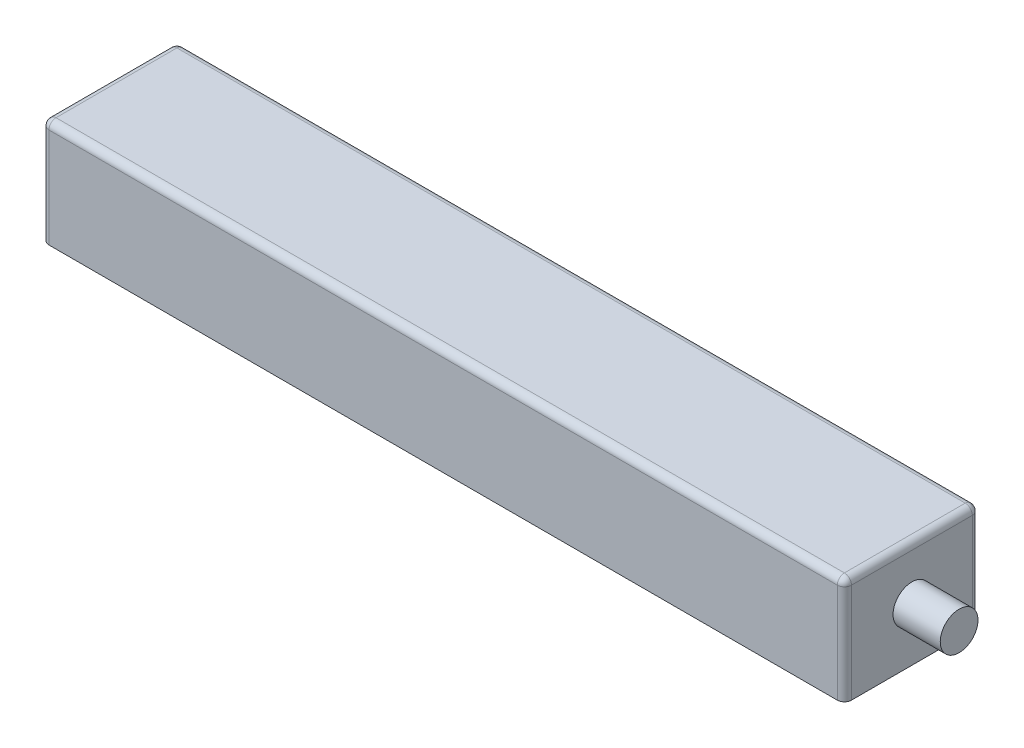
ISO-10303-21;
HEADER;
FILE_DESCRIPTION(('STEP AP214'),'2;1');
FILE_NAME('part.step','',(''),(''),'','','');
FILE_SCHEMA(('AUTOMOTIVE_DESIGN { 1 0 10303 214 1 1 1 1 }'));
ENDSEC;
DATA;
#1=APPLICATION_CONTEXT('core data for automotive mechanical design processes');
#2=APPLICATION_PROTOCOL_DEFINITION('international standard','automotive_design',2000,#1);
#3=PRODUCT_CONTEXT('',#1,'mechanical');
#4=PRODUCT('Part','Part','',(#3));
#5=PRODUCT_RELATED_PRODUCT_CATEGORY('part','',(#4));
#6=PRODUCT_DEFINITION_FORMATION('','',#4);
#7=PRODUCT_DEFINITION_CONTEXT('part definition',#1,'design');
#8=PRODUCT_DEFINITION('design','',#6,#7);
#9=PRODUCT_DEFINITION_SHAPE('','',#8);
#10=(LENGTH_UNIT() NAMED_UNIT(*) SI_UNIT(.MILLI.,.METRE.));
#11=(NAMED_UNIT(*) PLANE_ANGLE_UNIT() SI_UNIT($,.RADIAN.));
#12=(NAMED_UNIT(*) SI_UNIT($,.STERADIAN.) SOLID_ANGLE_UNIT());
#13=UNCERTAINTY_MEASURE_WITH_UNIT(LENGTH_MEASURE(1.E-05),#10,'distance_accuracy_value','');
#14=(GEOMETRIC_REPRESENTATION_CONTEXT(3) GLOBAL_UNCERTAINTY_ASSIGNED_CONTEXT((#13)) GLOBAL_UNIT_ASSIGNED_CONTEXT((#10,
#11,#12)) REPRESENTATION_CONTEXT('',''));
#15=CARTESIAN_POINT('',(0.,0.,0.));
#16=DIRECTION('',(0.,0.,1.));
#17=DIRECTION('',(1.,0.,0.));
#18=AXIS2_PLACEMENT_3D('',#15,#16,#17);
#19=CARTESIAN_POINT('',(-85.,22.6,14.3));
#20=DIRECTION('',(1.,0.,0.));
#21=DIRECTION('',(0.,0.,-1.));
#22=AXIS2_PLACEMENT_3D('',#19,#20,#21);
#23=PLANE('',#22);
#24=DIRECTION('',(0.,0.,1.));
#25=VECTOR('',#24,1.);
#26=CARTESIAN_POINT('',(-85.,21.1,-14.3));
#27=LINE('',#26,#25);
#28=CARTESIAN_POINT('',(-85.,21.1,12.8));
#29=VERTEX_POINT('',#28);
#30=CARTESIAN_POINT('',(-85.,21.1,-12.8));
#31=VERTEX_POINT('',#30);
#32=EDGE_CURVE('E50',#29,#31,#27,.F.);
#33=ORIENTED_EDGE('',*,*,#32,.T.);
#34=DIRECTION('',(0.,-1.,0.));
#35=VECTOR('',#34,1.);
#36=CARTESIAN_POINT('',(-85.,22.6,-12.8));
#37=LINE('',#36,#35);
#38=CARTESIAN_POINT('',(-85.,0.,-12.8));
#39=VERTEX_POINT('',#38);
#40=EDGE_CURVE('E169',#31,#39,#37,.T.);
#41=ORIENTED_EDGE('',*,*,#40,.T.);
#42=DIRECTION('',(0.,0.,1.));
#43=VECTOR('',#42,1.);
#44=CARTESIAN_POINT('',(-85.,0.,14.3));
#45=LINE('',#44,#43);
#46=CARTESIAN_POINT('',(-85.,0.,12.8));
#47=VERTEX_POINT('',#46);
#48=EDGE_CURVE('E206',#39,#47,#45,.T.);
#49=ORIENTED_EDGE('',*,*,#48,.T.);
#50=DIRECTION('',(0.,-1.,0.));
#51=VECTOR('',#50,1.);
#52=CARTESIAN_POINT('',(-85.,22.6,12.8));
#53=LINE('',#52,#51);
#54=EDGE_CURVE('E55',#47,#29,#53,.F.);
#55=ORIENTED_EDGE('',*,*,#54,.T.);
#56=EDGE_LOOP('',(#33,#41,#49,#55));
#57=FACE_BOUND('',#56,.T.);
#58=CARTESIAN_POINT('',(-85.,11.3,0.));
#59=DIRECTION('',(1.,0.,0.));
#60=DIRECTION('',(0.,0.,-1.));
#61=AXIS2_PLACEMENT_3D('',#58,#59,#60);
#62=CIRCLE('',#61,4.);
#63=CARTESIAN_POINT('',(-85.,11.3,-4.));
#64=VERTEX_POINT('',#63);
#65=EDGE_CURVE('E140',#64,#64,#62,.F.);
#66=ORIENTED_EDGE('',*,*,#65,.F.);
#67=EDGE_LOOP('',(#66));
#68=FACE_BOUND('',#67,.T.);
#69=ADVANCED_FACE('F33',(#57,#68),#23,.F.);
#70=CARTESIAN_POINT('',(85.,22.6,14.3));
#71=DIRECTION('',(-1.,0.,0.));
#72=DIRECTION('',(0.,0.,1.));
#73=AXIS2_PLACEMENT_3D('',#70,#71,#72);
#74=PLANE('',#73);
#75=DIRECTION('',(0.,0.,-1.));
#76=VECTOR('',#75,1.);
#77=CARTESIAN_POINT('',(85.,0.,14.3));
#78=LINE('',#77,#76);
#79=CARTESIAN_POINT('',(85.,0.,12.8));
#80=VERTEX_POINT('',#79);
#81=CARTESIAN_POINT('',(85.,0.,-12.8));
#82=VERTEX_POINT('',#81);
#83=EDGE_CURVE('E213',#80,#82,#78,.T.);
#84=ORIENTED_EDGE('',*,*,#83,.T.);
#85=DIRECTION('',(0.,-1.,0.));
#86=VECTOR('',#85,1.);
#87=CARTESIAN_POINT('',(85.,22.6,-12.8));
#88=LINE('',#87,#86);
#89=CARTESIAN_POINT('',(85.,21.1,-12.8));
#90=VERTEX_POINT('',#89);
#91=EDGE_CURVE('E159',#82,#90,#88,.F.);
#92=ORIENTED_EDGE('',*,*,#91,.T.);
#93=DIRECTION('',(0.,0.,-1.));
#94=VECTOR('',#93,1.);
#95=CARTESIAN_POINT('',(85.,21.1,14.3));
#96=LINE('',#95,#94);
#97=CARTESIAN_POINT('',(85.,21.1,12.8));
#98=VERTEX_POINT('',#97);
#99=EDGE_CURVE('E157',#90,#98,#96,.F.);
#100=ORIENTED_EDGE('',*,*,#99,.T.);
#101=DIRECTION('',(0.,-1.,0.));
#102=VECTOR('',#101,1.);
#103=CARTESIAN_POINT('',(85.,22.6,12.8));
#104=LINE('',#103,#102);
#105=EDGE_CURVE('E155',#98,#80,#104,.T.);
#106=ORIENTED_EDGE('',*,*,#105,.T.);
#107=EDGE_LOOP('',(#84,#92,#100,#106));
#108=FACE_BOUND('',#107,.T.);
#109=CARTESIAN_POINT('',(85.,11.3,0.));
#110=DIRECTION('',(-1.,0.,0.));
#111=DIRECTION('',(0.,0.,1.));
#112=AXIS2_PLACEMENT_3D('',#109,#110,#111);
#113=CIRCLE('',#112,4.);
#114=CARTESIAN_POINT('',(85.,11.3,4.));
#115=VERTEX_POINT('',#114);
#116=EDGE_CURVE('E219',#115,#115,#113,.F.);
#117=ORIENTED_EDGE('',*,*,#116,.F.);
#118=EDGE_LOOP('',(#117));
#119=FACE_BOUND('',#118,.T.);
#120=ADVANCED_FACE('F267',(#108,#119),#74,.F.);
#121=CARTESIAN_POINT('',(85.,22.6,14.3));
#122=DIRECTION('',(0.,0.,-1.));
#123=DIRECTION('',(-1.,0.,0.));
#124=AXIS2_PLACEMENT_3D('',#121,#122,#123);
#125=PLANE('',#124);
#126=DIRECTION('',(1.,0.,0.));
#127=VECTOR('',#126,1.);
#128=CARTESIAN_POINT('',(-85.,21.1,14.3));
#129=LINE('',#128,#127);
#130=CARTESIAN_POINT('',(83.5,21.1,14.3));
#131=VERTEX_POINT('',#130);
#132=CARTESIAN_POINT('',(-83.5,21.1,14.3));
#133=VERTEX_POINT('',#132);
#134=EDGE_CURVE('E163',#131,#133,#129,.F.);
#135=ORIENTED_EDGE('',*,*,#134,.T.);
#136=DIRECTION('',(0.,-1.,0.));
#137=VECTOR('',#136,1.);
#138=CARTESIAN_POINT('',(-83.5,22.6,14.3));
#139=LINE('',#138,#137);
#140=CARTESIAN_POINT('',(-83.5,0.,14.3));
#141=VERTEX_POINT('',#140);
#142=EDGE_CURVE('E165',#133,#141,#139,.T.);
#143=ORIENTED_EDGE('',*,*,#142,.T.);
#144=DIRECTION('',(1.,0.,0.));
#145=VECTOR('',#144,1.);
#146=CARTESIAN_POINT('',(85.,0.,14.3));
#147=LINE('',#146,#145);
#148=CARTESIAN_POINT('',(83.5,0.,14.3));
#149=VERTEX_POINT('',#148);
#150=EDGE_CURVE('E210',#141,#149,#147,.T.);
#151=ORIENTED_EDGE('',*,*,#150,.T.);
#152=DIRECTION('',(0.,-1.,0.));
#153=VECTOR('',#152,1.);
#154=CARTESIAN_POINT('',(83.5,22.6,14.3));
#155=LINE('',#154,#153);
#156=EDGE_CURVE('E161',#149,#131,#155,.F.);
#157=ORIENTED_EDGE('',*,*,#156,.T.);
#158=EDGE_LOOP('',(#135,#143,#151,#157));
#159=FACE_BOUND('',#158,.T.);
#160=ADVANCED_FACE('F273',(#159),#125,.F.);
#161=CARTESIAN_POINT('',(85.,22.6,-14.3));
#162=DIRECTION('',(0.,0.,1.));
#163=DIRECTION('',(1.,0.,0.));
#164=AXIS2_PLACEMENT_3D('',#161,#162,#163);
#165=PLANE('',#164);
#166=DIRECTION('',(-1.,0.,0.));
#167=VECTOR('',#166,1.);
#168=CARTESIAN_POINT('',(85.,0.,-14.3));
#169=LINE('',#168,#167);
#170=CARTESIAN_POINT('',(83.5,0.,-14.3));
#171=VERTEX_POINT('',#170);
#172=CARTESIAN_POINT('',(-83.5,0.,-14.3));
#173=VERTEX_POINT('',#172);
#174=EDGE_CURVE('E216',#171,#173,#169,.T.);
#175=ORIENTED_EDGE('',*,*,#174,.T.);
#176=DIRECTION('',(0.,-1.,0.));
#177=VECTOR('',#176,1.);
#178=CARTESIAN_POINT('',(-83.5,22.6,-14.3));
#179=LINE('',#178,#177);
#180=CARTESIAN_POINT('',(-83.5,21.1,-14.3));
#181=VERTEX_POINT('',#180);
#182=EDGE_CURVE('E153',#173,#181,#179,.F.);
#183=ORIENTED_EDGE('',*,*,#182,.T.);
#184=DIRECTION('',(-1.,0.,0.));
#185=VECTOR('',#184,1.);
#186=CARTESIAN_POINT('',(85.,21.1,-14.3));
#187=LINE('',#186,#185);
#188=CARTESIAN_POINT('',(83.5,21.1,-14.3));
#189=VERTEX_POINT('',#188);
#190=EDGE_CURVE('E118',#181,#189,#187,.F.);
#191=ORIENTED_EDGE('',*,*,#190,.T.);
#192=DIRECTION('',(0.,-1.,0.));
#193=VECTOR('',#192,1.);
#194=CARTESIAN_POINT('',(83.5,22.6,-14.3));
#195=LINE('',#194,#193);
#196=EDGE_CURVE('E146',#189,#171,#195,.T.);
#197=ORIENTED_EDGE('',*,*,#196,.T.);
#198=EDGE_LOOP('',(#175,#183,#191,#197));
#199=FACE_BOUND('',#198,.T.);
#200=ADVANCED_FACE('F242',(#199),#165,.F.);
#201=CARTESIAN_POINT('',(-85.,22.6,-14.3));
#202=DIRECTION('',(0.,1.,0.));
#203=DIRECTION('',(0.,0.,1.));
#204=AXIS2_PLACEMENT_3D('',#201,#202,#203);
#205=PLANE('',#204);
#206=DIRECTION('',(0.,0.,-1.));
#207=VECTOR('',#206,1.);
#208=CARTESIAN_POINT('',(83.5,22.6,-14.3));
#209=LINE('',#208,#207);
#210=CARTESIAN_POINT('',(83.5,22.6,12.8));
#211=VERTEX_POINT('',#210);
#212=CARTESIAN_POINT('',(83.5,22.6,-12.8));
#213=VERTEX_POINT('',#212);
#214=EDGE_CURVE('E144',#211,#213,#209,.T.);
#215=ORIENTED_EDGE('',*,*,#214,.T.);
#216=DIRECTION('',(-1.,0.,0.));
#217=VECTOR('',#216,1.);
#218=CARTESIAN_POINT('',(-85.,22.6,-12.8));
#219=LINE('',#218,#217);
#220=CARTESIAN_POINT('',(-83.5,22.6,-12.8));
#221=VERTEX_POINT('',#220);
#222=EDGE_CURVE('E116',#213,#221,#219,.T.);
#223=ORIENTED_EDGE('',*,*,#222,.T.);
#224=DIRECTION('',(0.,0.,1.));
#225=VECTOR('',#224,1.);
#226=CARTESIAN_POINT('',(-83.5,22.6,14.3));
#227=LINE('',#226,#225);
#228=CARTESIAN_POINT('',(-83.5,22.6,12.8));
#229=VERTEX_POINT('',#228);
#230=EDGE_CURVE('E133',#221,#229,#227,.T.);
#231=ORIENTED_EDGE('',*,*,#230,.T.);
#232=DIRECTION('',(1.,0.,0.));
#233=VECTOR('',#232,1.);
#234=CARTESIAN_POINT('',(85.,22.6,12.8));
#235=LINE('',#234,#233);
#236=EDGE_CURVE('E139',#229,#211,#235,.T.);
#237=ORIENTED_EDGE('',*,*,#236,.T.);
#238=EDGE_LOOP('',(#215,#223,#231,#237));
#239=FACE_BOUND('',#238,.T.);
#240=ADVANCED_FACE('F142',(#239),#205,.T.);
#241=CARTESIAN_POINT('',(-85.,0.,-14.3));
#242=DIRECTION('',(0.,1.,0.));
#243=DIRECTION('',(0.,0.,1.));
#244=AXIS2_PLACEMENT_3D('',#241,#242,#243);
#245=PLANE('',#244);
#246=ORIENTED_EDGE('',*,*,#48,.F.);
#247=CARTESIAN_POINT('',(-83.5,0.,-12.8));
#248=DIRECTION('',(0.,1.,0.));
#249=DIRECTION('',(0.,0.,1.));
#250=AXIS2_PLACEMENT_3D('',#247,#248,#249);
#251=CIRCLE('',#250,1.5);
#252=EDGE_CURVE('E11',#39,#173,#251,.F.);
#253=ORIENTED_EDGE('',*,*,#252,.T.);
#254=ORIENTED_EDGE('',*,*,#174,.F.);
#255=CARTESIAN_POINT('',(83.5,0.,-12.8));
#256=DIRECTION('',(0.,1.,0.));
#257=DIRECTION('',(0.,0.,1.));
#258=AXIS2_PLACEMENT_3D('',#255,#256,#257);
#259=CIRCLE('',#258,1.5);
#260=EDGE_CURVE('E173',#171,#82,#259,.F.);
#261=ORIENTED_EDGE('',*,*,#260,.T.);
#262=ORIENTED_EDGE('',*,*,#83,.F.);
#263=CARTESIAN_POINT('',(83.5,0.,12.8));
#264=DIRECTION('',(0.,1.,0.));
#265=DIRECTION('',(0.,0.,1.));
#266=AXIS2_PLACEMENT_3D('',#263,#264,#265);
#267=CIRCLE('',#266,1.5);
#268=EDGE_CURVE('E171',#80,#149,#267,.F.);
#269=ORIENTED_EDGE('',*,*,#268,.T.);
#270=ORIENTED_EDGE('',*,*,#150,.F.);
#271=CARTESIAN_POINT('',(-83.5,0.,12.8));
#272=DIRECTION('',(0.,1.,0.));
#273=DIRECTION('',(0.,0.,1.));
#274=AXIS2_PLACEMENT_3D('',#271,#272,#273);
#275=CIRCLE('',#274,1.5);
#276=EDGE_CURVE('E42',#141,#47,#275,.F.);
#277=ORIENTED_EDGE('',*,*,#276,.T.);
#278=EDGE_LOOP('',(#246,#253,#254,#261,#262,#269,#270,#277));
#279=FACE_BOUND('',#278,.T.);
#280=ADVANCED_FACE('F250',(#279),#245,.F.);
#281=CARTESIAN_POINT('',(95.,11.3,0.));
#282=DIRECTION('',(-1.,0.,0.));
#283=DIRECTION('',(0.,0.,1.));
#284=AXIS2_PLACEMENT_3D('',#281,#282,#283);
#285=CYLINDRICAL_SURFACE('',#284,4.);
#286=CARTESIAN_POINT('',(95.,11.3,0.));
#287=DIRECTION('',(1.,0.,0.));
#288=DIRECTION('',(0.,0.,-1.));
#289=AXIS2_PLACEMENT_3D('',#286,#287,#288);
#290=CIRCLE('',#289,4.);
#291=CARTESIAN_POINT('',(95.,11.3,-4.));
#292=VERTEX_POINT('',#291);
#293=EDGE_CURVE('E201',#292,#292,#290,.T.);
#294=ORIENTED_EDGE('',*,*,#293,.F.);
#295=EDGE_LOOP('',(#294));
#296=FACE_BOUND('',#295,.T.);
#297=ORIENTED_EDGE('',*,*,#116,.T.);
#298=EDGE_LOOP('',(#297));
#299=FACE_BOUND('',#298,.T.);
#300=ADVANCED_FACE('F390',(#296,#299),#285,.T.);
#301=CARTESIAN_POINT('',(95.,11.3,0.));
#302=DIRECTION('',(1.,0.,0.));
#303=DIRECTION('',(0.,0.,-1.));
#304=AXIS2_PLACEMENT_3D('',#301,#302,#303);
#305=PLANE('',#304);
#306=ORIENTED_EDGE('',*,*,#293,.T.);
#307=EDGE_LOOP('',(#306));
#308=FACE_BOUND('',#307,.T.);
#309=ADVANCED_FACE('F374',(#308),#305,.T.);
#310=CARTESIAN_POINT('',(-90.,11.3,0.));
#311=DIRECTION('',(1.,0.,0.));
#312=DIRECTION('',(0.,0.,-1.));
#313=AXIS2_PLACEMENT_3D('',#310,#311,#312);
#314=CYLINDRICAL_SURFACE('',#313,4.);
#315=CARTESIAN_POINT('',(-90.,11.3,0.));
#316=DIRECTION('',(-1.,0.,0.));
#317=DIRECTION('',(0.,0.,1.));
#318=AXIS2_PLACEMENT_3D('',#315,#316,#317);
#319=CIRCLE('',#318,4.);
#320=CARTESIAN_POINT('',(-90.,11.3,4.));
#321=VERTEX_POINT('',#320);
#322=EDGE_CURVE('E198',#321,#321,#319,.T.);
#323=ORIENTED_EDGE('',*,*,#322,.F.);
#324=EDGE_LOOP('',(#323));
#325=FACE_BOUND('',#324,.T.);
#326=ORIENTED_EDGE('',*,*,#65,.T.);
#327=EDGE_LOOP('',(#326));
#328=FACE_BOUND('',#327,.T.);
#329=ADVANCED_FACE('F367',(#325,#328),#314,.T.);
#330=CARTESIAN_POINT('',(-90.,11.3,0.));
#331=DIRECTION('',(-1.,0.,0.));
#332=DIRECTION('',(0.,0.,1.));
#333=AXIS2_PLACEMENT_3D('',#330,#331,#332);
#334=PLANE('',#333);
#335=ORIENTED_EDGE('',*,*,#322,.T.);
#336=EDGE_LOOP('',(#335));
#337=FACE_BOUND('',#336,.T.);
#338=ADVANCED_FACE('F359',(#337),#334,.T.);
#339=CARTESIAN_POINT('',(83.5,22.6,12.8));
#340=DIRECTION('',(0.,-1.,0.));
#341=DIRECTION('',(0.,0.,-1.));
#342=AXIS2_PLACEMENT_3D('',#339,#340,#341);
#343=CYLINDRICAL_SURFACE('',#342,1.5);
#344=ORIENTED_EDGE('',*,*,#268,.F.);
#345=ORIENTED_EDGE('',*,*,#105,.F.);
#346=CARTESIAN_POINT('',(83.5,21.1,12.8));
#347=DIRECTION('',(0.,1.,0.));
#348=DIRECTION('',(0.,0.,1.));
#349=AXIS2_PLACEMENT_3D('',#346,#347,#348);
#350=CIRCLE('',#349,1.5);
#351=EDGE_CURVE('E37',#131,#98,#350,.T.);
#352=ORIENTED_EDGE('',*,*,#351,.F.);
#353=ORIENTED_EDGE('',*,*,#156,.F.);
#354=EDGE_LOOP('',(#344,#345,#352,#353));
#355=FACE_BOUND('',#354,.T.);
#356=ADVANCED_FACE('F35',(#355),#343,.T.);
#357=CARTESIAN_POINT('',(-85.,21.1,12.8));
#358=DIRECTION('',(-1.,0.,0.));
#359=DIRECTION('',(0.,0.,1.));
#360=AXIS2_PLACEMENT_3D('',#357,#358,#359);
#361=CYLINDRICAL_SURFACE('',#360,1.5);
#362=CARTESIAN_POINT('',(-83.5,21.1,12.8));
#363=DIRECTION('',(-1.,0.,0.));
#364=DIRECTION('',(0.,0.,1.));
#365=AXIS2_PLACEMENT_3D('',#362,#363,#364);
#366=CIRCLE('',#365,1.5);
#367=EDGE_CURVE('E190',#133,#229,#366,.T.);
#368=ORIENTED_EDGE('',*,*,#367,.F.);
#369=ORIENTED_EDGE('',*,*,#134,.F.);
#370=CARTESIAN_POINT('',(83.5,21.1,12.8));
#371=DIRECTION('',(1.,0.,0.));
#372=DIRECTION('',(0.,0.,-1.));
#373=AXIS2_PLACEMENT_3D('',#370,#371,#372);
#374=CIRCLE('',#373,1.5);
#375=EDGE_CURVE('E192',#211,#131,#374,.T.);
#376=ORIENTED_EDGE('',*,*,#375,.F.);
#377=ORIENTED_EDGE('',*,*,#236,.F.);
#378=EDGE_LOOP('',(#368,#369,#376,#377));
#379=FACE_BOUND('',#378,.T.);
#380=ADVANCED_FACE('F226',(#379),#361,.T.);
#381=CARTESIAN_POINT('',(-83.5,22.6,12.8));
#382=DIRECTION('',(0.,-1.,0.));
#383=DIRECTION('',(0.,0.,-1.));
#384=AXIS2_PLACEMENT_3D('',#381,#382,#383);
#385=CYLINDRICAL_SURFACE('',#384,1.5);
#386=ORIENTED_EDGE('',*,*,#276,.F.);
#387=ORIENTED_EDGE('',*,*,#142,.F.);
#388=CARTESIAN_POINT('',(-83.5,21.1,12.8));
#389=DIRECTION('',(0.,1.,0.));
#390=DIRECTION('',(0.,0.,1.));
#391=AXIS2_PLACEMENT_3D('',#388,#389,#390);
#392=CIRCLE('',#391,1.5);
#393=EDGE_CURVE('E187',#29,#133,#392,.T.);
#394=ORIENTED_EDGE('',*,*,#393,.F.);
#395=ORIENTED_EDGE('',*,*,#54,.F.);
#396=EDGE_LOOP('',(#386,#387,#394,#395));
#397=FACE_BOUND('',#396,.T.);
#398=ADVANCED_FACE('F255',(#397),#385,.T.);
#399=CARTESIAN_POINT('',(83.5,21.1,12.8));
#400=DIRECTION('',(0.,0.,1.));
#401=DIRECTION('',(1.,0.,0.));
#402=AXIS2_PLACEMENT_3D('',#399,#400,#401);
#403=SPHERICAL_SURFACE('',#402,1.5);
#404=ORIENTED_EDGE('',*,*,#375,.T.);
#405=ORIENTED_EDGE('',*,*,#351,.T.);
#406=CARTESIAN_POINT('',(83.5,21.1,12.8));
#407=DIRECTION('',(0.,0.,1.));
#408=DIRECTION('',(0.,-1.,0.));
#409=AXIS2_PLACEMENT_3D('',#406,#407,#408);
#410=CIRCLE('',#409,1.5);
#411=EDGE_CURVE('E184',#211,#98,#410,.F.);
#412=ORIENTED_EDGE('',*,*,#411,.F.);
#413=EDGE_LOOP('',(#404,#405,#412));
#414=FACE_BOUND('',#413,.T.);
#415=ADVANCED_FACE('F227',(#414),#403,.T.);
#416=CARTESIAN_POINT('',(-83.5,21.1,12.8));
#417=DIRECTION('',(0.,0.,1.));
#418=DIRECTION('',(1.,0.,0.));
#419=AXIS2_PLACEMENT_3D('',#416,#417,#418);
#420=SPHERICAL_SURFACE('',#419,1.5);
#421=ORIENTED_EDGE('',*,*,#393,.T.);
#422=ORIENTED_EDGE('',*,*,#367,.T.);
#423=CARTESIAN_POINT('',(-83.5,21.1,12.8));
#424=DIRECTION('',(0.,0.,1.));
#425=DIRECTION('',(1.,0.,0.));
#426=AXIS2_PLACEMENT_3D('',#423,#424,#425);
#427=CIRCLE('',#426,1.5);
#428=EDGE_CURVE('E136',#29,#229,#427,.F.);
#429=ORIENTED_EDGE('',*,*,#428,.F.);
#430=EDGE_LOOP('',(#421,#422,#429));
#431=FACE_BOUND('',#430,.T.);
#432=ADVANCED_FACE('F257',(#431),#420,.T.);
#433=CARTESIAN_POINT('',(83.5,22.6,-12.8));
#434=DIRECTION('',(0.,-1.,0.));
#435=DIRECTION('',(0.,0.,-1.));
#436=AXIS2_PLACEMENT_3D('',#433,#434,#435);
#437=CYLINDRICAL_SURFACE('',#436,1.5);
#438=ORIENTED_EDGE('',*,*,#260,.F.);
#439=ORIENTED_EDGE('',*,*,#196,.F.);
#440=CARTESIAN_POINT('',(83.5,21.1,-12.8));
#441=DIRECTION('',(0.,1.,0.));
#442=DIRECTION('',(0.,0.,1.));
#443=AXIS2_PLACEMENT_3D('',#440,#441,#442);
#444=CIRCLE('',#443,1.5);
#445=EDGE_CURVE('E180',#90,#189,#444,.T.);
#446=ORIENTED_EDGE('',*,*,#445,.F.);
#447=ORIENTED_EDGE('',*,*,#91,.F.);
#448=EDGE_LOOP('',(#438,#439,#446,#447));
#449=FACE_BOUND('',#448,.T.);
#450=ADVANCED_FACE('F239',(#449),#437,.T.);
#451=CARTESIAN_POINT('',(83.5,21.1,-14.3));
#452=DIRECTION('',(0.,0.,1.));
#453=DIRECTION('',(1.,0.,0.));
#454=AXIS2_PLACEMENT_3D('',#451,#452,#453);
#455=CYLINDRICAL_SURFACE('',#454,1.5);
#456=ORIENTED_EDGE('',*,*,#411,.T.);
#457=ORIENTED_EDGE('',*,*,#99,.F.);
#458=CARTESIAN_POINT('',(83.5,21.1,-12.8));
#459=DIRECTION('',(0.,0.,-1.));
#460=DIRECTION('',(-1.,0.,0.));
#461=AXIS2_PLACEMENT_3D('',#458,#459,#460);
#462=CIRCLE('',#461,1.5);
#463=EDGE_CURVE('E130',#213,#90,#462,.T.);
#464=ORIENTED_EDGE('',*,*,#463,.F.);
#465=ORIENTED_EDGE('',*,*,#214,.F.);
#466=EDGE_LOOP('',(#456,#457,#464,#465));
#467=FACE_BOUND('',#466,.T.);
#468=ADVANCED_FACE('F230',(#467),#455,.T.);
#469=CARTESIAN_POINT('',(-83.5,21.1,-14.3));
#470=DIRECTION('',(0.,0.,-1.));
#471=DIRECTION('',(-1.,0.,0.));
#472=AXIS2_PLACEMENT_3D('',#469,#470,#471);
#473=CYLINDRICAL_SURFACE('',#472,1.5);
#474=ORIENTED_EDGE('',*,*,#428,.T.);
#475=ORIENTED_EDGE('',*,*,#230,.F.);
#476=CARTESIAN_POINT('',(-83.5,21.1,-12.8));
#477=DIRECTION('',(0.,0.,-1.));
#478=DIRECTION('',(0.,1.,0.));
#479=AXIS2_PLACEMENT_3D('',#476,#477,#478);
#480=CIRCLE('',#479,1.5);
#481=EDGE_CURVE('E124',#31,#221,#480,.T.);
#482=ORIENTED_EDGE('',*,*,#481,.F.);
#483=ORIENTED_EDGE('',*,*,#32,.F.);
#484=EDGE_LOOP('',(#474,#475,#482,#483));
#485=FACE_BOUND('',#484,.T.);
#486=ADVANCED_FACE('F134',(#485),#473,.T.);
#487=CARTESIAN_POINT('',(-83.5,22.6,-12.8));
#488=DIRECTION('',(0.,-1.,0.));
#489=DIRECTION('',(0.,0.,-1.));
#490=AXIS2_PLACEMENT_3D('',#487,#488,#489);
#491=CYLINDRICAL_SURFACE('',#490,1.5);
#492=ORIENTED_EDGE('',*,*,#252,.F.);
#493=ORIENTED_EDGE('',*,*,#40,.F.);
#494=CARTESIAN_POINT('',(-83.5,21.1,-12.8));
#495=DIRECTION('',(0.,1.,0.));
#496=DIRECTION('',(0.,0.,1.));
#497=AXIS2_PLACEMENT_3D('',#494,#495,#496);
#498=CIRCLE('',#497,1.5);
#499=EDGE_CURVE('E128',#181,#31,#498,.T.);
#500=ORIENTED_EDGE('',*,*,#499,.F.);
#501=ORIENTED_EDGE('',*,*,#182,.F.);
#502=EDGE_LOOP('',(#492,#493,#500,#501));
#503=FACE_BOUND('',#502,.T.);
#504=ADVANCED_FACE('F246',(#503),#491,.T.);
#505=CARTESIAN_POINT('',(83.5,21.1,-12.8));
#506=DIRECTION('',(0.,0.,1.));
#507=DIRECTION('',(1.,0.,0.));
#508=AXIS2_PLACEMENT_3D('',#505,#506,#507);
#509=SPHERICAL_SURFACE('',#508,1.5);
#510=ORIENTED_EDGE('',*,*,#463,.T.);
#511=ORIENTED_EDGE('',*,*,#445,.T.);
#512=CARTESIAN_POINT('',(83.5,21.1,-12.8));
#513=DIRECTION('',(1.,0.,0.));
#514=DIRECTION('',(0.,0.,-1.));
#515=AXIS2_PLACEMENT_3D('',#512,#513,#514);
#516=CIRCLE('',#515,1.5);
#517=EDGE_CURVE('E121',#213,#189,#516,.F.);
#518=ORIENTED_EDGE('',*,*,#517,.F.);
#519=EDGE_LOOP('',(#510,#511,#518));
#520=FACE_BOUND('',#519,.T.);
#521=ADVANCED_FACE('F234',(#520),#509,.T.);
#522=CARTESIAN_POINT('',(-83.5,21.1,-12.8));
#523=DIRECTION('',(0.,0.,1.));
#524=DIRECTION('',(1.,0.,0.));
#525=AXIS2_PLACEMENT_3D('',#522,#523,#524);
#526=SPHERICAL_SURFACE('',#525,1.5);
#527=ORIENTED_EDGE('',*,*,#499,.T.);
#528=ORIENTED_EDGE('',*,*,#481,.T.);
#529=CARTESIAN_POINT('',(-83.5,21.1,-12.8));
#530=DIRECTION('',(-1.,0.,0.));
#531=DIRECTION('',(0.,0.,1.));
#532=AXIS2_PLACEMENT_3D('',#529,#530,#531);
#533=CIRCLE('',#532,1.5);
#534=EDGE_CURVE('E112',#181,#221,#533,.F.);
#535=ORIENTED_EDGE('',*,*,#534,.F.);
#536=EDGE_LOOP('',(#527,#528,#535));
#537=FACE_BOUND('',#536,.T.);
#538=ADVANCED_FACE('F126',(#537),#526,.T.);
#539=CARTESIAN_POINT('',(-85.,21.1,-12.8));
#540=DIRECTION('',(1.,0.,0.));
#541=DIRECTION('',(0.,0.,-1.));
#542=AXIS2_PLACEMENT_3D('',#539,#540,#541);
#543=CYLINDRICAL_SURFACE('',#542,1.5);
#544=ORIENTED_EDGE('',*,*,#517,.T.);
#545=ORIENTED_EDGE('',*,*,#190,.F.);
#546=ORIENTED_EDGE('',*,*,#534,.T.);
#547=ORIENTED_EDGE('',*,*,#222,.F.);
#548=EDGE_LOOP('',(#544,#545,#546,#547));
#549=FACE_BOUND('',#548,.T.);
#550=ADVANCED_FACE('F114',(#549),#543,.T.);
#551=CLOSED_SHELL('',(#69,#120,#160,#200,#240,#280,#300,#309,#329,#338,#356,#380,#398,#415,#432,
#450,#468,#486,#504,#521,#538,#550));
#552=MANIFOLD_SOLID_BREP('B2',#551);
#553=ADVANCED_BREP_SHAPE_REPRESENTATION('',(#18,#552),#14);
#554=SHAPE_DEFINITION_REPRESENTATION(#9,#553);
ENDSEC;
END-ISO-10303-21;
